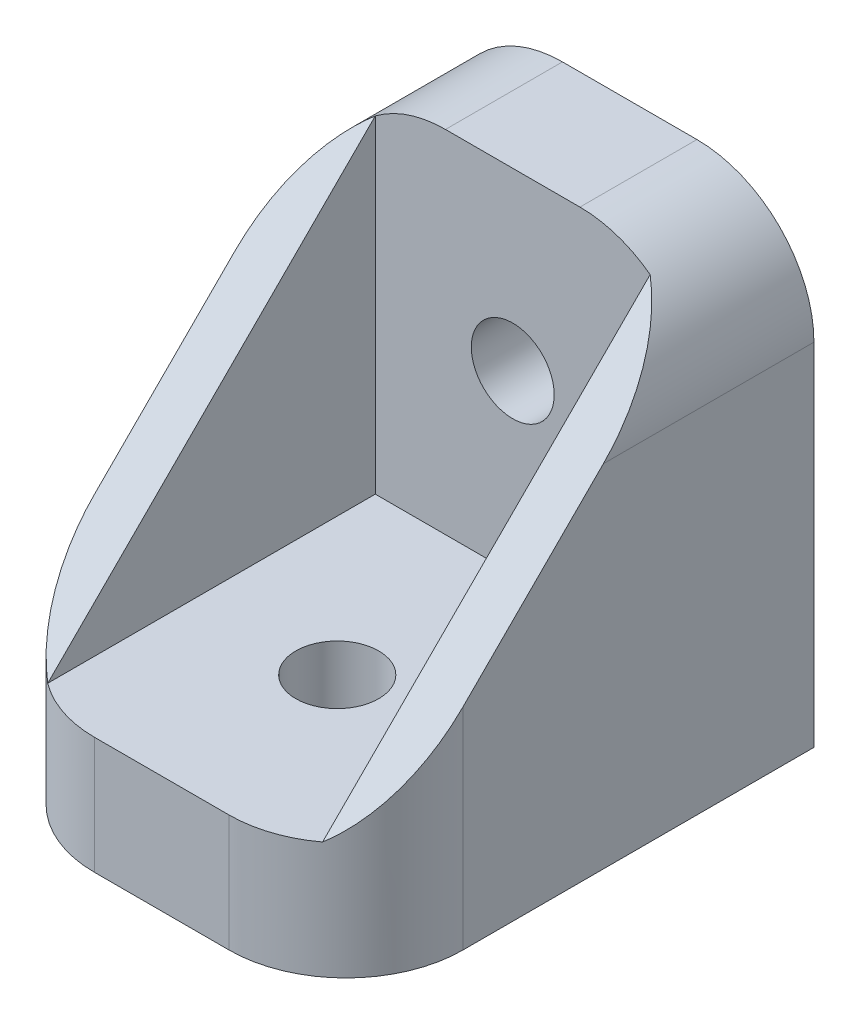
ISO-10303-21;
HEADER;
FILE_DESCRIPTION(('STEP AP214'),'2;1');
FILE_NAME('part.step','',(''),(''),'','','');
FILE_SCHEMA(('AUTOMOTIVE_DESIGN { 1 0 10303 214 1 1 1 1 }'));
ENDSEC;
DATA;
#1=APPLICATION_CONTEXT('core data for automotive mechanical design processes');
#2=APPLICATION_PROTOCOL_DEFINITION('international standard','automotive_design',2000,#1);
#3=PRODUCT_CONTEXT('',#1,'mechanical');
#4=PRODUCT('Part','Part','',(#3));
#5=PRODUCT_RELATED_PRODUCT_CATEGORY('part','',(#4));
#6=PRODUCT_DEFINITION_FORMATION('','',#4);
#7=PRODUCT_DEFINITION_CONTEXT('part definition',#1,'design');
#8=PRODUCT_DEFINITION('design','',#6,#7);
#9=PRODUCT_DEFINITION_SHAPE('','',#8);
#10=(LENGTH_UNIT() NAMED_UNIT(*) SI_UNIT(.MILLI.,.METRE.));
#11=(NAMED_UNIT(*) PLANE_ANGLE_UNIT() SI_UNIT($,.RADIAN.));
#12=(NAMED_UNIT(*) SI_UNIT($,.STERADIAN.) SOLID_ANGLE_UNIT());
#13=UNCERTAINTY_MEASURE_WITH_UNIT(LENGTH_MEASURE(1.E-05),#10,'distance_accuracy_value','');
#14=(GEOMETRIC_REPRESENTATION_CONTEXT(3) GLOBAL_UNCERTAINTY_ASSIGNED_CONTEXT((#13)) GLOBAL_UNIT_ASSIGNED_CONTEXT((#10,
#11,#12)) REPRESENTATION_CONTEXT('',''));
#15=CARTESIAN_POINT('',(0.,0.,0.));
#16=DIRECTION('',(0.,0.,1.));
#17=DIRECTION('',(1.,0.,0.));
#18=AXIS2_PLACEMENT_3D('',#15,#16,#17);
#19=CARTESIAN_POINT('',(20.,6.35,-19.05));
#20=DIRECTION('',(0.,0.,-1.));
#21=DIRECTION('',(-1.,0.,0.));
#22=AXIS2_PLACEMENT_3D('',#19,#20,#21);
#23=PLANE('',#22);
#24=CARTESIAN_POINT('',(6.35,19.05,-19.05));
#25=DIRECTION('',(0.,0.,-1.));
#26=DIRECTION('',(-1.,0.,0.));
#27=AXIS2_PLACEMENT_3D('',#24,#25,#26);
#28=CIRCLE('',#27,6.35);
#29=CARTESIAN_POINT('',(6.35,25.4,-19.05));
#30=VERTEX_POINT('',#29);
#31=CARTESIAN_POINT('',(2.54,24.13,-19.05));
#32=VERTEX_POINT('',#31);
#33=EDGE_CURVE('E225',#30,#32,#28,.F.);
#34=ORIENTED_EDGE('',*,*,#33,.T.);
#35=DIRECTION('',(0.,-1.,0.));
#36=VECTOR('',#35,1.);
#37=CARTESIAN_POINT('',(2.54,43.3605122421383,-19.05));
#38=LINE('',#37,#36);
#39=CARTESIAN_POINT('',(2.54,6.35,-19.05));
#40=VERTEX_POINT('',#39);
#41=EDGE_CURVE('E162',#32,#40,#38,.T.);
#42=ORIENTED_EDGE('',*,*,#41,.T.);
#43=DIRECTION('',(-1.,0.,0.));
#44=VECTOR('',#43,1.);
#45=CARTESIAN_POINT('',(20.,6.35,-19.05));
#46=LINE('',#45,#44);
#47=CARTESIAN_POINT('',(17.46,6.35,-19.05));
#48=VERTEX_POINT('',#47);
#49=EDGE_CURVE('E55',#48,#40,#46,.T.);
#50=ORIENTED_EDGE('',*,*,#49,.F.);
#51=DIRECTION('',(0.,-1.,0.));
#52=VECTOR('',#51,1.);
#53=CARTESIAN_POINT('',(17.46,43.3605122421383,-19.05));
#54=LINE('',#53,#52);
#55=CARTESIAN_POINT('',(17.46,24.13,-19.05));
#56=VERTEX_POINT('',#55);
#57=EDGE_CURVE('E152',#56,#48,#54,.T.);
#58=ORIENTED_EDGE('',*,*,#57,.F.);
#59=CARTESIAN_POINT('',(13.65,19.05,-19.05));
#60=DIRECTION('',(0.,0.,-1.));
#61=DIRECTION('',(-1.,0.,0.));
#62=AXIS2_PLACEMENT_3D('',#59,#60,#61);
#63=CIRCLE('',#62,6.35);
#64=CARTESIAN_POINT('',(13.65,25.4,-19.05));
#65=VERTEX_POINT('',#64);
#66=EDGE_CURVE('E223',#56,#65,#63,.F.);
#67=ORIENTED_EDGE('',*,*,#66,.T.);
#68=DIRECTION('',(-1.,0.,0.));
#69=VECTOR('',#68,1.);
#70=CARTESIAN_POINT('',(20.,25.4,-19.05));
#71=LINE('',#70,#69);
#72=EDGE_CURVE('E191',#65,#30,#71,.T.);
#73=ORIENTED_EDGE('',*,*,#72,.T.);
#74=EDGE_LOOP('',(#34,#42,#50,#58,#67,#73));
#75=FACE_BOUND('',#74,.T.);
#76=CARTESIAN_POINT('',(10.,15.875,-19.05));
#77=DIRECTION('',(0.,0.,1.));
#78=DIRECTION('',(1.,0.,0.));
#79=AXIS2_PLACEMENT_3D('',#76,#77,#78);
#80=CIRCLE('',#79,2.25);
#81=CARTESIAN_POINT('',(12.25,15.875,-19.05));
#82=VERTEX_POINT('',#81);
#83=EDGE_CURVE('E164',#82,#82,#80,.T.);
#84=ORIENTED_EDGE('',*,*,#83,.F.);
#85=EDGE_LOOP('',(#84));
#86=FACE_BOUND('',#85,.T.);
#87=ADVANCED_FACE('F36',(#75,#86),#23,.F.);
#88=CARTESIAN_POINT('',(20.,6.35,0.));
#89=DIRECTION('',(0.,-1.,0.));
#90=DIRECTION('',(0.,0.,-1.));
#91=AXIS2_PLACEMENT_3D('',#88,#89,#90);
#92=PLANE('',#91);
#93=CARTESIAN_POINT('',(13.65,6.35,-6.35));
#94=DIRECTION('',(0.,-1.,0.));
#95=DIRECTION('',(0.,0.,-1.));
#96=AXIS2_PLACEMENT_3D('',#93,#94,#95);
#97=CIRCLE('',#96,6.35);
#98=CARTESIAN_POINT('',(13.65,6.35,0.));
#99=VERTEX_POINT('',#98);
#100=CARTESIAN_POINT('',(17.46,6.35,-1.27));
#101=VERTEX_POINT('',#100);
#102=EDGE_CURVE('E137',#99,#101,#97,.F.);
#103=ORIENTED_EDGE('',*,*,#102,.T.);
#104=DIRECTION('',(0.,0.,1.));
#105=VECTOR('',#104,1.);
#106=CARTESIAN_POINT('',(17.46,6.35,0.));
#107=LINE('',#106,#105);
#108=EDGE_CURVE('E51',#48,#101,#107,.T.);
#109=ORIENTED_EDGE('',*,*,#108,.F.);
#110=ORIENTED_EDGE('',*,*,#49,.T.);
#111=DIRECTION('',(0.,0.,1.));
#112=VECTOR('',#111,1.);
#113=CARTESIAN_POINT('',(2.54,6.35,0.));
#114=LINE('',#113,#112);
#115=CARTESIAN_POINT('',(2.54,6.35,-1.27));
#116=VERTEX_POINT('',#115);
#117=EDGE_CURVE('E155',#40,#116,#114,.T.);
#118=ORIENTED_EDGE('',*,*,#117,.T.);
#119=CARTESIAN_POINT('',(6.35,6.35,-6.35));
#120=DIRECTION('',(0.,-1.,0.));
#121=DIRECTION('',(0.,0.,-1.));
#122=AXIS2_PLACEMENT_3D('',#119,#120,#121);
#123=CIRCLE('',#122,6.35);
#124=CARTESIAN_POINT('',(6.35,6.35,0.));
#125=VERTEX_POINT('',#124);
#126=EDGE_CURVE('E147',#116,#125,#123,.F.);
#127=ORIENTED_EDGE('',*,*,#126,.T.);
#128=DIRECTION('',(-1.,0.,0.));
#129=VECTOR('',#128,1.);
#130=CARTESIAN_POINT('',(20.,6.35,0.));
#131=LINE('',#130,#129);
#132=EDGE_CURVE('E146',#99,#125,#131,.T.);
#133=ORIENTED_EDGE('',*,*,#132,.F.);
#134=EDGE_LOOP('',(#103,#109,#110,#118,#127,#133));
#135=FACE_BOUND('',#134,.T.);
#136=CARTESIAN_POINT('',(10.,6.35,-9.525));
#137=DIRECTION('',(0.,1.,0.));
#138=DIRECTION('',(0.,0.,1.));
#139=AXIS2_PLACEMENT_3D('',#136,#137,#138);
#140=CIRCLE('',#139,2.249999945);
#141=CARTESIAN_POINT('',(10.,6.35,-7.275000055));
#142=VERTEX_POINT('',#141);
#143=EDGE_CURVE('E170',#142,#142,#140,.T.);
#144=ORIENTED_EDGE('',*,*,#143,.F.);
#145=EDGE_LOOP('',(#144));
#146=FACE_BOUND('',#145,.T.);
#147=ADVANCED_FACE('F143',(#135,#146),#92,.F.);
#148=CARTESIAN_POINT('',(20.,0.,-25.4));
#149=DIRECTION('',(0.,1.,0.));
#150=DIRECTION('',(0.,0.,1.));
#151=AXIS2_PLACEMENT_3D('',#148,#149,#150);
#152=PLANE('',#151);
#153=CARTESIAN_POINT('',(10.,0.,-9.525));
#154=DIRECTION('',(0.,1.,0.));
#155=DIRECTION('',(0.,0.,1.));
#156=AXIS2_PLACEMENT_3D('',#153,#154,#155);
#157=CIRCLE('',#156,2.249999945);
#158=CARTESIAN_POINT('',(10.,0.,-7.275000055));
#159=VERTEX_POINT('',#158);
#160=EDGE_CURVE('E173',#159,#159,#157,.T.);
#161=ORIENTED_EDGE('',*,*,#160,.T.);
#162=EDGE_LOOP('',(#161));
#163=FACE_BOUND('',#162,.T.);
#164=DIRECTION('',(-1.,0.,0.));
#165=VECTOR('',#164,1.);
#166=CARTESIAN_POINT('',(20.,0.,0.));
#167=LINE('',#166,#165);
#168=CARTESIAN_POINT('',(13.65,0.,0.));
#169=VERTEX_POINT('',#168);
#170=CARTESIAN_POINT('',(6.35,0.,0.));
#171=VERTEX_POINT('',#170);
#172=EDGE_CURVE('E183',#169,#171,#167,.T.);
#173=ORIENTED_EDGE('',*,*,#172,.T.);
#174=CARTESIAN_POINT('',(6.35,0.,-6.35));
#175=DIRECTION('',(0.,1.,0.));
#176=DIRECTION('',(0.,0.,1.));
#177=AXIS2_PLACEMENT_3D('',#174,#175,#176);
#178=CIRCLE('',#177,6.35);
#179=CARTESIAN_POINT('',(0.,0.,-6.35));
#180=VERTEX_POINT('',#179);
#181=EDGE_CURVE('E207',#171,#180,#178,.F.);
#182=ORIENTED_EDGE('',*,*,#181,.T.);
#183=DIRECTION('',(0.,0.,-1.));
#184=VECTOR('',#183,1.);
#185=CARTESIAN_POINT('',(0.,0.,-25.4));
#186=LINE('',#185,#184);
#187=CARTESIAN_POINT('',(0.,0.,-25.4));
#188=VERTEX_POINT('',#187);
#189=EDGE_CURVE('E176',#180,#188,#186,.T.);
#190=ORIENTED_EDGE('',*,*,#189,.T.);
#191=DIRECTION('',(-1.,0.,0.));
#192=VECTOR('',#191,1.);
#193=CARTESIAN_POINT('',(20.,0.,-25.4));
#194=LINE('',#193,#192);
#195=CARTESIAN_POINT('',(20.,0.,-25.4));
#196=VERTEX_POINT('',#195);
#197=EDGE_CURVE('E197',#196,#188,#194,.T.);
#198=ORIENTED_EDGE('',*,*,#197,.F.);
#199=DIRECTION('',(0.,0.,-1.));
#200=VECTOR('',#199,1.);
#201=CARTESIAN_POINT('',(20.,0.,-25.4));
#202=LINE('',#201,#200);
#203=CARTESIAN_POINT('',(20.,0.,-6.35));
#204=VERTEX_POINT('',#203);
#205=EDGE_CURVE('E177',#204,#196,#202,.T.);
#206=ORIENTED_EDGE('',*,*,#205,.F.);
#207=CARTESIAN_POINT('',(13.65,0.,-6.35));
#208=DIRECTION('',(0.,1.,0.));
#209=DIRECTION('',(0.,0.,1.));
#210=AXIS2_PLACEMENT_3D('',#207,#208,#209);
#211=CIRCLE('',#210,6.35);
#212=EDGE_CURVE('E205',#204,#169,#211,.F.);
#213=ORIENTED_EDGE('',*,*,#212,.T.);
#214=EDGE_LOOP('',(#173,#182,#190,#198,#206,#213));
#215=FACE_BOUND('',#214,.T.);
#216=ADVANCED_FACE('F261',(#163,#215),#152,.F.);
#217=CARTESIAN_POINT('',(20.,25.4,-25.4));
#218=DIRECTION('',(0.,0.,1.));
#219=DIRECTION('',(1.,0.,0.));
#220=AXIS2_PLACEMENT_3D('',#217,#218,#219);
#221=PLANE('',#220);
#222=CARTESIAN_POINT('',(10.,15.875,-25.4));
#223=DIRECTION('',(0.,0.,1.));
#224=DIRECTION('',(1.,0.,0.));
#225=AXIS2_PLACEMENT_3D('',#222,#223,#224);
#226=CIRCLE('',#225,2.25);
#227=CARTESIAN_POINT('',(12.25,15.875,-25.4));
#228=VERTEX_POINT('',#227);
#229=EDGE_CURVE('E167',#228,#228,#226,.T.);
#230=ORIENTED_EDGE('',*,*,#229,.T.);
#231=EDGE_LOOP('',(#230));
#232=FACE_BOUND('',#231,.T.);
#233=DIRECTION('',(0.,1.,0.));
#234=VECTOR('',#233,1.);
#235=CARTESIAN_POINT('',(0.,25.4,-25.4));
#236=LINE('',#235,#234);
#237=CARTESIAN_POINT('',(0.,19.05,-25.4));
#238=VERTEX_POINT('',#237);
#239=EDGE_CURVE('E180',#188,#238,#236,.T.);
#240=ORIENTED_EDGE('',*,*,#239,.T.);
#241=CARTESIAN_POINT('',(6.35,19.05,-25.4));
#242=DIRECTION('',(0.,0.,1.));
#243=DIRECTION('',(1.,0.,0.));
#244=AXIS2_PLACEMENT_3D('',#241,#242,#243);
#245=CIRCLE('',#244,6.35);
#246=CARTESIAN_POINT('',(6.35,25.4,-25.4));
#247=VERTEX_POINT('',#246);
#248=EDGE_CURVE('E44',#238,#247,#245,.F.);
#249=ORIENTED_EDGE('',*,*,#248,.T.);
#250=DIRECTION('',(-1.,0.,0.));
#251=VECTOR('',#250,1.);
#252=CARTESIAN_POINT('',(20.,25.4,-25.4));
#253=LINE('',#252,#251);
#254=CARTESIAN_POINT('',(13.65,25.4,-25.4));
#255=VERTEX_POINT('',#254);
#256=EDGE_CURVE('E194',#255,#247,#253,.T.);
#257=ORIENTED_EDGE('',*,*,#256,.F.);
#258=CARTESIAN_POINT('',(13.65,19.05,-25.4));
#259=DIRECTION('',(0.,0.,1.));
#260=DIRECTION('',(1.,0.,0.));
#261=AXIS2_PLACEMENT_3D('',#258,#259,#260);
#262=CIRCLE('',#261,6.35);
#263=CARTESIAN_POINT('',(20.,19.05,-25.4));
#264=VERTEX_POINT('',#263);
#265=EDGE_CURVE('E228',#255,#264,#262,.F.);
#266=ORIENTED_EDGE('',*,*,#265,.T.);
#267=DIRECTION('',(0.,1.,0.));
#268=VECTOR('',#267,1.);
#269=CARTESIAN_POINT('',(20.,25.4,-25.4));
#270=LINE('',#269,#268);
#271=EDGE_CURVE('E179',#196,#264,#270,.T.);
#272=ORIENTED_EDGE('',*,*,#271,.F.);
#273=ORIENTED_EDGE('',*,*,#197,.T.);
#274=EDGE_LOOP('',(#240,#249,#257,#266,#272,#273));
#275=FACE_BOUND('',#274,.T.);
#276=ADVANCED_FACE('F232',(#232,#275),#221,.F.);
#277=CARTESIAN_POINT('',(20.,25.4,-19.05));
#278=DIRECTION('',(0.,-1.,0.));
#279=DIRECTION('',(0.,0.,-1.));
#280=AXIS2_PLACEMENT_3D('',#277,#278,#279);
#281=PLANE('',#280);
#282=ORIENTED_EDGE('',*,*,#256,.T.);
#283=DIRECTION('',(0.,0.,1.));
#284=VECTOR('',#283,1.);
#285=CARTESIAN_POINT('',(6.35,25.4,-19.05));
#286=LINE('',#285,#284);
#287=EDGE_CURVE('E220',#247,#30,#286,.T.);
#288=ORIENTED_EDGE('',*,*,#287,.T.);
#289=ORIENTED_EDGE('',*,*,#72,.F.);
#290=DIRECTION('',(0.,0.,1.));
#291=VECTOR('',#290,1.);
#292=CARTESIAN_POINT('',(13.65,25.4,-19.05));
#293=LINE('',#292,#291);
#294=EDGE_CURVE('E218',#65,#255,#293,.F.);
#295=ORIENTED_EDGE('',*,*,#294,.T.);
#296=EDGE_LOOP('',(#282,#288,#289,#295));
#297=FACE_BOUND('',#296,.T.);
#298=ADVANCED_FACE('F239',(#297),#281,.F.);
#299=CARTESIAN_POINT('',(20.,0.,0.));
#300=DIRECTION('',(0.,0.,-1.));
#301=DIRECTION('',(-1.,0.,0.));
#302=AXIS2_PLACEMENT_3D('',#299,#300,#301);
#303=PLANE('',#302);
#304=ORIENTED_EDGE('',*,*,#132,.T.);
#305=DIRECTION('',(0.,-1.,0.));
#306=VECTOR('',#305,1.);
#307=CARTESIAN_POINT('',(6.35,0.,0.));
#308=LINE('',#307,#306);
#309=EDGE_CURVE('E202',#125,#171,#308,.T.);
#310=ORIENTED_EDGE('',*,*,#309,.T.);
#311=ORIENTED_EDGE('',*,*,#172,.F.);
#312=DIRECTION('',(0.,-1.,0.));
#313=VECTOR('',#312,1.);
#314=CARTESIAN_POINT('',(13.65,0.,0.));
#315=LINE('',#314,#313);
#316=EDGE_CURVE('E200',#169,#99,#315,.F.);
#317=ORIENTED_EDGE('',*,*,#316,.T.);
#318=EDGE_LOOP('',(#304,#310,#311,#317));
#319=FACE_BOUND('',#318,.T.);
#320=ADVANCED_FACE('F259',(#319),#303,.F.);
#321=CARTESIAN_POINT('',(20.,0.,0.));
#322=DIRECTION('',(-1.,0.,0.));
#323=DIRECTION('',(0.,0.,1.));
#324=AXIS2_PLACEMENT_3D('',#321,#322,#323);
#325=PLANE('',#324);
#326=DIRECTION('',(0.,0.,1.));
#327=VECTOR('',#326,1.);
#328=CARTESIAN_POINT('',(20.,19.05,0.));
#329=LINE('',#328,#327);
#330=CARTESIAN_POINT('',(20.,19.05,-13.97));
#331=VERTEX_POINT('',#330);
#332=EDGE_CURVE('E214',#264,#331,#329,.T.);
#333=ORIENTED_EDGE('',*,*,#332,.T.);
#334=DIRECTION('',(0.,-0.707106781186548,0.707106781186547));
#335=VECTOR('',#334,1.);
#336=CARTESIAN_POINT('',(20.,2.54,2.54));
#337=LINE('',#336,#335);
#338=CARTESIAN_POINT('',(20.,11.43,-6.35));
#339=VERTEX_POINT('',#338);
#340=EDGE_CURVE('E270',#331,#339,#337,.T.);
#341=ORIENTED_EDGE('',*,*,#340,.T.);
#342=DIRECTION('',(0.,-1.,0.));
#343=VECTOR('',#342,1.);
#344=CARTESIAN_POINT('',(20.,0.,-6.35));
#345=LINE('',#344,#343);
#346=EDGE_CURVE('E139',#339,#204,#345,.T.);
#347=ORIENTED_EDGE('',*,*,#346,.T.);
#348=ORIENTED_EDGE('',*,*,#205,.T.);
#349=ORIENTED_EDGE('',*,*,#271,.T.);
#350=EDGE_LOOP('',(#333,#341,#347,#348,#349));
#351=FACE_BOUND('',#350,.T.);
#352=ADVANCED_FACE('F267',(#351),#325,.F.);
#353=CARTESIAN_POINT('',(0.,0.,0.));
#354=DIRECTION('',(-1.,0.,0.));
#355=DIRECTION('',(0.,0.,1.));
#356=AXIS2_PLACEMENT_3D('',#353,#354,#355);
#357=PLANE('',#356);
#358=DIRECTION('',(0.,-0.707106781186548,0.707106781186547));
#359=VECTOR('',#358,1.);
#360=CARTESIAN_POINT('',(0.,2.54,2.54));
#361=LINE('',#360,#359);
#362=CARTESIAN_POINT('',(0.,19.05,-13.97));
#363=VERTEX_POINT('',#362);
#364=CARTESIAN_POINT('',(0.,11.43,-6.35));
#365=VERTEX_POINT('',#364);
#366=EDGE_CURVE('E271',#363,#365,#361,.T.);
#367=ORIENTED_EDGE('',*,*,#366,.F.);
#368=DIRECTION('',(0.,0.,1.));
#369=VECTOR('',#368,1.);
#370=CARTESIAN_POINT('',(0.,19.05,-25.4));
#371=LINE('',#370,#369);
#372=EDGE_CURVE('E209',#363,#238,#371,.F.);
#373=ORIENTED_EDGE('',*,*,#372,.T.);
#374=ORIENTED_EDGE('',*,*,#239,.F.);
#375=ORIENTED_EDGE('',*,*,#189,.F.);
#376=DIRECTION('',(0.,-1.,0.));
#377=VECTOR('',#376,1.);
#378=CARTESIAN_POINT('',(0.,6.35,-6.35));
#379=LINE('',#378,#377);
#380=EDGE_CURVE('E148',#180,#365,#379,.F.);
#381=ORIENTED_EDGE('',*,*,#380,.T.);
#382=EDGE_LOOP('',(#367,#373,#374,#375,#381));
#383=FACE_BOUND('',#382,.T.);
#384=ADVANCED_FACE('F280',(#383),#357,.T.);
#385=CARTESIAN_POINT('',(10.,-13.65,-9.525));
#386=DIRECTION('',(0.,1.,0.));
#387=DIRECTION('',(0.,0.,1.));
#388=AXIS2_PLACEMENT_3D('',#385,#386,#387);
#389=CYLINDRICAL_SURFACE('',#388,2.249999945);
#390=ORIENTED_EDGE('',*,*,#143,.T.);
#391=EDGE_LOOP('',(#390));
#392=FACE_BOUND('',#391,.T.);
#393=ORIENTED_EDGE('',*,*,#160,.F.);
#394=EDGE_LOOP('',(#393));
#395=FACE_BOUND('',#394,.T.);
#396=ADVANCED_FACE('F282',(#392,#395),#389,.F.);
#397=CARTESIAN_POINT('',(10.,15.875,-39.05));
#398=DIRECTION('',(0.,0.,1.));
#399=DIRECTION('',(1.,0.,0.));
#400=AXIS2_PLACEMENT_3D('',#397,#398,#399);
#401=CYLINDRICAL_SURFACE('',#400,2.25);
#402=ORIENTED_EDGE('',*,*,#83,.T.);
#403=EDGE_LOOP('',(#402));
#404=FACE_BOUND('',#403,.T.);
#405=ORIENTED_EDGE('',*,*,#229,.F.);
#406=EDGE_LOOP('',(#405));
#407=FACE_BOUND('',#406,.T.);
#408=ADVANCED_FACE('F288',(#404,#407),#401,.F.);
#409=CARTESIAN_POINT('',(6.35,0.,-6.35));
#410=DIRECTION('',(0.,1.,0.));
#411=DIRECTION('',(0.,0.,1.));
#412=AXIS2_PLACEMENT_3D('',#409,#410,#411);
#413=CYLINDRICAL_SURFACE('',#412,6.35);
#414=CARTESIAN_POINT('',(6.35,11.43,-6.35));
#415=DIRECTION('',(0.,-0.707106781186547,-0.707106781186548));
#416=DIRECTION('',(0.,0.707106781186548,-0.707106781186547));
#417=AXIS2_PLACEMENT_3D('',#414,#415,#416);
#418=ELLIPSE('',#417,8.98025612106915,6.35);
#419=EDGE_CURVE('E153',#365,#116,#418,.F.);
#420=ORIENTED_EDGE('',*,*,#419,.F.);
#421=ORIENTED_EDGE('',*,*,#380,.F.);
#422=ORIENTED_EDGE('',*,*,#181,.F.);
#423=ORIENTED_EDGE('',*,*,#309,.F.);
#424=ORIENTED_EDGE('',*,*,#126,.F.);
#425=EDGE_LOOP('',(#420,#421,#422,#423,#424));
#426=FACE_BOUND('',#425,.T.);
#427=ADVANCED_FACE('F255',(#426),#413,.T.);
#428=CARTESIAN_POINT('',(13.65,0.,-6.35));
#429=DIRECTION('',(0.,-1.,0.));
#430=DIRECTION('',(0.,0.,-1.));
#431=AXIS2_PLACEMENT_3D('',#428,#429,#430);
#432=CYLINDRICAL_SURFACE('',#431,6.35);
#433=CARTESIAN_POINT('',(13.65,11.43,-6.35));
#434=DIRECTION('',(0.,-0.707106781186547,-0.707106781186548));
#435=DIRECTION('',(0.,-0.707106781186548,0.707106781186547));
#436=AXIS2_PLACEMENT_3D('',#433,#434,#435);
#437=ELLIPSE('',#436,8.98025612106915,6.35);
#438=EDGE_CURVE('E125',#101,#339,#437,.F.);
#439=ORIENTED_EDGE('',*,*,#438,.F.);
#440=ORIENTED_EDGE('',*,*,#102,.F.);
#441=ORIENTED_EDGE('',*,*,#316,.F.);
#442=ORIENTED_EDGE('',*,*,#212,.F.);
#443=ORIENTED_EDGE('',*,*,#346,.F.);
#444=EDGE_LOOP('',(#439,#440,#441,#442,#443));
#445=FACE_BOUND('',#444,.T.);
#446=ADVANCED_FACE('F135',(#445),#432,.T.);
#447=CARTESIAN_POINT('',(6.35,19.05,-19.05));
#448=DIRECTION('',(0.,0.,-1.));
#449=DIRECTION('',(0.,1.,0.));
#450=AXIS2_PLACEMENT_3D('',#447,#448,#449);
#451=CYLINDRICAL_SURFACE('',#450,6.35);
#452=CARTESIAN_POINT('',(6.35,19.05,-13.97));
#453=DIRECTION('',(0.,-0.707106781186547,-0.707106781186548));
#454=DIRECTION('',(0.,0.707106781186548,-0.707106781186547));
#455=AXIS2_PLACEMENT_3D('',#452,#453,#454);
#456=ELLIPSE('',#455,8.98025612106915,6.35);
#457=EDGE_CURVE('E157',#32,#363,#456,.F.);
#458=ORIENTED_EDGE('',*,*,#457,.F.);
#459=ORIENTED_EDGE('',*,*,#33,.F.);
#460=ORIENTED_EDGE('',*,*,#287,.F.);
#461=ORIENTED_EDGE('',*,*,#248,.F.);
#462=ORIENTED_EDGE('',*,*,#372,.F.);
#463=EDGE_LOOP('',(#458,#459,#460,#461,#462));
#464=FACE_BOUND('',#463,.T.);
#465=ADVANCED_FACE('F243',(#464),#451,.T.);
#466=CARTESIAN_POINT('',(13.65,19.05,0.));
#467=DIRECTION('',(0.,0.,1.));
#468=DIRECTION('',(0.,-1.,0.));
#469=AXIS2_PLACEMENT_3D('',#466,#467,#468);
#470=CYLINDRICAL_SURFACE('',#469,6.35);
#471=CARTESIAN_POINT('',(13.65,19.05,-13.97));
#472=DIRECTION('',(0.,-0.707106781186547,-0.707106781186548));
#473=DIRECTION('',(0.,-0.707106781186548,0.707106781186547));
#474=AXIS2_PLACEMENT_3D('',#471,#472,#473);
#475=ELLIPSE('',#474,8.98025612106915,6.35);
#476=EDGE_CURVE('E128',#331,#56,#475,.F.);
#477=ORIENTED_EDGE('',*,*,#476,.F.);
#478=ORIENTED_EDGE('',*,*,#332,.F.);
#479=ORIENTED_EDGE('',*,*,#265,.F.);
#480=ORIENTED_EDGE('',*,*,#294,.F.);
#481=ORIENTED_EDGE('',*,*,#66,.F.);
#482=EDGE_LOOP('',(#477,#478,#479,#480,#481));
#483=FACE_BOUND('',#482,.T.);
#484=ADVANCED_FACE('F38',(#483),#470,.T.);
#485=CARTESIAN_POINT('',(2.54,43.3605122421383,0.));
#486=DIRECTION('',(1.,0.,0.));
#487=DIRECTION('',(0.,0.,-1.));
#488=AXIS2_PLACEMENT_3D('',#485,#486,#487);
#489=PLANE('',#488);
#490=DIRECTION('',(0.,0.707106781186548,-0.707106781186547));
#491=VECTOR('',#490,1.);
#492=CARTESIAN_POINT('',(2.54,24.2202561210692,-19.1402561210692));
#493=LINE('',#492,#491);
#494=EDGE_CURVE('E140',#116,#32,#493,.T.);
#495=ORIENTED_EDGE('',*,*,#494,.F.);
#496=ORIENTED_EDGE('',*,*,#117,.F.);
#497=ORIENTED_EDGE('',*,*,#41,.F.);
#498=EDGE_LOOP('',(#495,#496,#497));
#499=FACE_BOUND('',#498,.T.);
#500=ADVANCED_FACE('F250',(#499),#489,.T.);
#501=CARTESIAN_POINT('',(17.46,43.3605122421383,0.));
#502=DIRECTION('',(1.,0.,0.));
#503=DIRECTION('',(0.,0.,-1.));
#504=AXIS2_PLACEMENT_3D('',#501,#502,#503);
#505=PLANE('',#504);
#506=ORIENTED_EDGE('',*,*,#108,.T.);
#507=DIRECTION('',(0.,0.707106781186548,-0.707106781186547));
#508=VECTOR('',#507,1.);
#509=CARTESIAN_POINT('',(17.46,24.2202561210692,-19.1402561210692));
#510=LINE('',#509,#508);
#511=EDGE_CURVE('E11',#101,#56,#510,.T.);
#512=ORIENTED_EDGE('',*,*,#511,.T.);
#513=ORIENTED_EDGE('',*,*,#57,.T.);
#514=EDGE_LOOP('',(#506,#512,#513));
#515=FACE_BOUND('',#514,.T.);
#516=ADVANCED_FACE('F150',(#515),#505,.F.);
#517=CARTESIAN_POINT('',(20.,2.54,2.54));
#518=DIRECTION('',(0.,-0.707106781186547,-0.707106781186548));
#519=DIRECTION('',(0.,0.707106781186548,-0.707106781186547));
#520=AXIS2_PLACEMENT_3D('',#517,#518,#519);
#521=PLANE('',#520);
#522=ORIENTED_EDGE('',*,*,#438,.T.);
#523=ORIENTED_EDGE('',*,*,#340,.F.);
#524=ORIENTED_EDGE('',*,*,#476,.T.);
#525=ORIENTED_EDGE('',*,*,#511,.F.);
#526=EDGE_LOOP('',(#522,#523,#524,#525));
#527=FACE_BOUND('',#526,.T.);
#528=ADVANCED_FACE('F124',(#527),#521,.F.);
#529=ORIENTED_EDGE('',*,*,#419,.T.);
#530=ORIENTED_EDGE('',*,*,#494,.T.);
#531=ORIENTED_EDGE('',*,*,#457,.T.);
#532=ORIENTED_EDGE('',*,*,#366,.T.);
#533=EDGE_LOOP('',(#529,#530,#531,#532));
#534=FACE_BOUND('',#533,.T.);
#535=ADVANCED_FACE('F278',(#534),#521,.F.);
#536=CLOSED_SHELL('',(#87,#147,#216,#276,#298,#320,#352,#384,#396,#408,#427,#446,#465,#484,#500,
#516,#528,#535));
#537=MANIFOLD_SOLID_BREP('B2',#536);
#538=ADVANCED_BREP_SHAPE_REPRESENTATION('',(#18,#537),#14);
#539=SHAPE_DEFINITION_REPRESENTATION(#9,#538);
ENDSEC;
END-ISO-10303-21;
